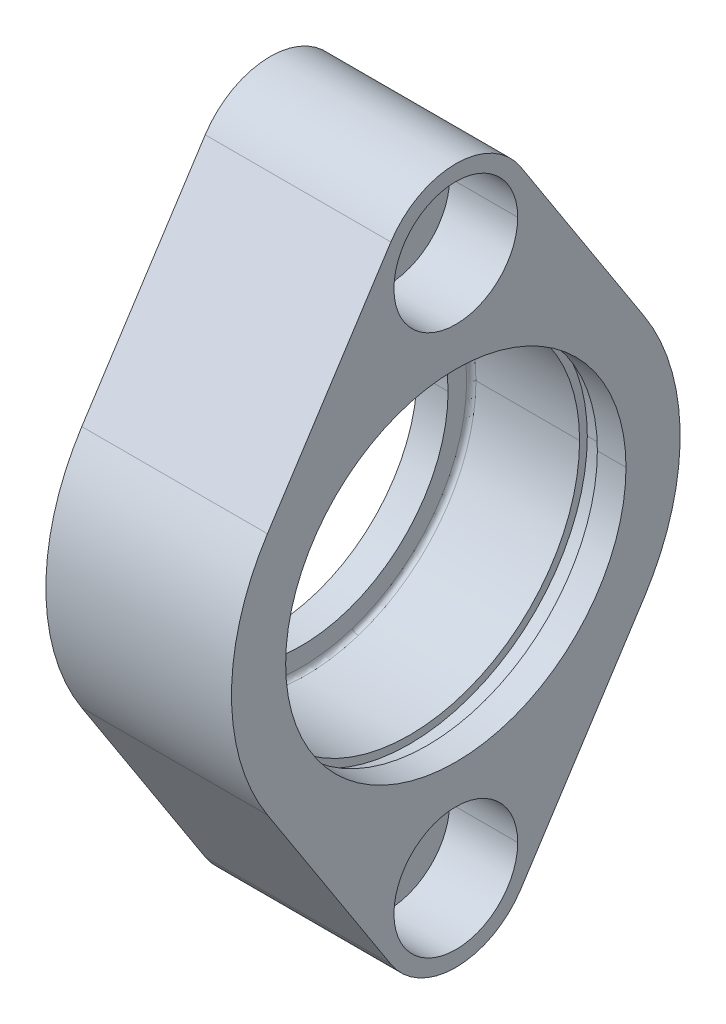
ISO-10303-21;
HEADER;
FILE_DESCRIPTION(('STEP AP214'),'2;1');
FILE_NAME('part.step','',(''),(''),'','','');
FILE_SCHEMA(('AUTOMOTIVE_DESIGN { 1 0 10303 214 1 1 1 1 }'));
ENDSEC;
DATA;
#1=APPLICATION_CONTEXT('core data for automotive mechanical design processes');
#2=APPLICATION_PROTOCOL_DEFINITION('international standard','automotive_design',2000,#1);
#3=PRODUCT_CONTEXT('',#1,'mechanical');
#4=PRODUCT('Part','Part','',(#3));
#5=PRODUCT_RELATED_PRODUCT_CATEGORY('part','',(#4));
#6=PRODUCT_DEFINITION_FORMATION('','',#4);
#7=PRODUCT_DEFINITION_CONTEXT('part definition',#1,'design');
#8=PRODUCT_DEFINITION('design','',#6,#7);
#9=PRODUCT_DEFINITION_SHAPE('','',#8);
#10=(LENGTH_UNIT() NAMED_UNIT(*) SI_UNIT(.MILLI.,.METRE.));
#11=(NAMED_UNIT(*) PLANE_ANGLE_UNIT() SI_UNIT($,.RADIAN.));
#12=(NAMED_UNIT(*) SI_UNIT($,.STERADIAN.) SOLID_ANGLE_UNIT());
#13=UNCERTAINTY_MEASURE_WITH_UNIT(LENGTH_MEASURE(1.E-05),#10,'distance_accuracy_value','');
#14=(GEOMETRIC_REPRESENTATION_CONTEXT(3) GLOBAL_UNCERTAINTY_ASSIGNED_CONTEXT((#13)) GLOBAL_UNIT_ASSIGNED_CONTEXT((#10,
#11,#12)) REPRESENTATION_CONTEXT('',''));
#15=CARTESIAN_POINT('',(0.,0.,0.));
#16=DIRECTION('',(0.,0.,1.));
#17=DIRECTION('',(1.,0.,0.));
#18=AXIS2_PLACEMENT_3D('',#15,#16,#17);
#19=CARTESIAN_POINT('',(44.,0.,0.));
#20=DIRECTION('',(1.,0.,0.));
#21=DIRECTION('',(0.,1.,0.));
#22=AXIS2_PLACEMENT_3D('',#19,#20,#21);
#23=CYLINDRICAL_SURFACE('',#22,11.);
#24=DIRECTION('',(1.,0.,0.));
#25=VECTOR('',#24,1.);
#26=CARTESIAN_POINT('',(-3.7,0.,11.));
#27=LINE('',#26,#25);
#28=CARTESIAN_POINT('',(-3.7,0.,11.));
#29=VERTEX_POINT('',#28);
#30=CARTESIAN_POINT('',(3.,0.,11.));
#31=VERTEX_POINT('',#30);
#32=EDGE_CURVE('E11',#29,#31,#27,.T.);
#33=ORIENTED_EDGE('',*,*,#32,.T.);
#34=CARTESIAN_POINT('',(3.,0.,0.));
#35=DIRECTION('',(1.,0.,0.));
#36=DIRECTION('',(0.,0.,-1.));
#37=AXIS2_PLACEMENT_3D('',#34,#35,#36);
#38=CIRCLE('',#37,11.);
#39=CARTESIAN_POINT('',(3.,0.,-11.));
#40=VERTEX_POINT('',#39);
#41=EDGE_CURVE('E24',#31,#40,#38,.T.);
#42=ORIENTED_EDGE('',*,*,#41,.T.);
#43=DIRECTION('',(1.,0.,0.));
#44=VECTOR('',#43,1.);
#45=CARTESIAN_POINT('',(-3.7,0.,-11.));
#46=LINE('',#45,#44);
#47=CARTESIAN_POINT('',(-3.7,0.,-11.));
#48=VERTEX_POINT('',#47);
#49=EDGE_CURVE('E536',#48,#40,#46,.T.);
#50=ORIENTED_EDGE('',*,*,#49,.F.);
#51=CARTESIAN_POINT('',(-3.7,0.,0.));
#52=DIRECTION('',(1.,0.,0.));
#53=DIRECTION('',(0.,0.,-1.));
#54=AXIS2_PLACEMENT_3D('',#51,#52,#53);
#55=CIRCLE('',#54,11.);
#56=CARTESIAN_POINT('',(-3.7,-10.4616216792467,-3.39918693812442));
#57=VERTEX_POINT('',#56);
#58=EDGE_CURVE('E531',#57,#48,#55,.T.);
#59=ORIENTED_EDGE('',*,*,#58,.F.);
#60=CARTESIAN_POINT('',(-3.7,0.,0.));
#61=DIRECTION('',(1.,0.,0.));
#62=DIRECTION('',(0.,0.,-1.));
#63=AXIS2_PLACEMENT_3D('',#60,#61,#62);
#64=CIRCLE('',#63,11.);
#65=EDGE_CURVE('E526',#29,#57,#64,.T.);
#66=ORIENTED_EDGE('',*,*,#65,.F.);
#67=EDGE_LOOP('',(#33,#42,#50,#59,#66));
#68=FACE_BOUND('',#67,.T.);
#69=ADVANCED_FACE('F16',(#68),#23,.F.);
#70=CARTESIAN_POINT('',(-3.70000000000012,0.,0.));
#71=DIRECTION('',(1.,0.,0.));
#72=DIRECTION('',(0.,0.309016994374947,-0.951056516295154));
#73=AXIS2_PLACEMENT_3D('',#70,#71,#72);
#74=TOROIDAL_SURFACE('',#73,10.7000000000001,0.299999999999874);
#75=CARTESIAN_POINT('',(-3.70000000000012,-10.1763047243583,-3.30648183981197));
#76=DIRECTION('',(0.,0.309016994374948,-0.951056516295153));
#77=DIRECTION('',(4.14483262526899E-13,-0.951056516295153,-0.309016994374948));
#78=AXIS2_PLACEMENT_3D('',#75,#76,#77);
#79=CIRCLE('',#78,0.299999999999874);
#80=CARTESIAN_POINT('',(-4.,-10.1763047243583,-3.30648183981197));
#81=VERTEX_POINT('',#80);
#82=EDGE_CURVE('E522',#57,#81,#79,.T.);
#83=ORIENTED_EDGE('',*,*,#82,.T.);
#84=CARTESIAN_POINT('',(-4.,0.,0.));
#85=DIRECTION('',(1.,0.,0.));
#86=DIRECTION('',(0.,0.,-1.));
#87=AXIS2_PLACEMENT_3D('',#84,#85,#86);
#88=CIRCLE('',#87,10.7);
#89=CARTESIAN_POINT('',(-4.,10.1763047243583,3.30648183981197));
#90=VERTEX_POINT('',#89);
#91=EDGE_CURVE('E517',#90,#81,#88,.T.);
#92=ORIENTED_EDGE('',*,*,#91,.F.);
#93=CARTESIAN_POINT('',(-3.70000000000012,10.1763047243583,3.30648183981197));
#94=DIRECTION('',(0.,-0.309016994374948,0.951056516295153));
#95=DIRECTION('',(4.15963559893067E-13,0.951056516295153,0.309016994374948));
#96=AXIS2_PLACEMENT_3D('',#93,#94,#95);
#97=CIRCLE('',#96,0.299999999999874);
#98=CARTESIAN_POINT('',(-3.7,10.4616216792467,3.39918693812442));
#99=VERTEX_POINT('',#98);
#100=EDGE_CURVE('E512',#99,#90,#97,.T.);
#101=ORIENTED_EDGE('',*,*,#100,.F.);
#102=CARTESIAN_POINT('',(-3.7,0.,0.));
#103=DIRECTION('',(1.,0.,0.));
#104=DIRECTION('',(0.,0.,-1.));
#105=AXIS2_PLACEMENT_3D('',#102,#103,#104);
#106=CIRCLE('',#105,11.);
#107=EDGE_CURVE('E507',#99,#29,#106,.T.);
#108=ORIENTED_EDGE('',*,*,#107,.T.);
#109=ORIENTED_EDGE('',*,*,#65,.T.);
#110=EDGE_LOOP('',(#83,#92,#101,#108,#109));
#111=FACE_BOUND('',#110,.T.);
#112=ADVANCED_FACE('F556',(#111),#74,.F.);
#113=CARTESIAN_POINT('',(44.,0.,0.));
#114=DIRECTION('',(1.,0.,0.));
#115=DIRECTION('',(0.,-1.,0.));
#116=AXIS2_PLACEMENT_3D('',#113,#114,#115);
#117=CYLINDRICAL_SURFACE('',#116,11.);
#118=ORIENTED_EDGE('',*,*,#32,.F.);
#119=ORIENTED_EDGE('',*,*,#107,.F.);
#120=CARTESIAN_POINT('',(-3.7,0.,0.));
#121=DIRECTION('',(1.,0.,0.));
#122=DIRECTION('',(0.,0.,-1.));
#123=AXIS2_PLACEMENT_3D('',#120,#121,#122);
#124=CIRCLE('',#123,11.);
#125=EDGE_CURVE('E502',#48,#99,#124,.T.);
#126=ORIENTED_EDGE('',*,*,#125,.F.);
#127=ORIENTED_EDGE('',*,*,#49,.T.);
#128=CARTESIAN_POINT('',(3.,0.,0.));
#129=DIRECTION('',(1.,0.,0.));
#130=DIRECTION('',(0.,0.,-1.));
#131=AXIS2_PLACEMENT_3D('',#128,#129,#130);
#132=CIRCLE('',#131,11.);
#133=EDGE_CURVE('E498',#40,#31,#132,.T.);
#134=ORIENTED_EDGE('',*,*,#133,.T.);
#135=EDGE_LOOP('',(#118,#119,#126,#127,#134));
#136=FACE_BOUND('',#135,.T.);
#137=ADVANCED_FACE('F547',(#136),#117,.F.);
#138=CARTESIAN_POINT('',(3.,0.,0.));
#139=DIRECTION('',(1.,0.,0.));
#140=DIRECTION('',(0.,0.,-1.));
#141=AXIS2_PLACEMENT_3D('',#138,#139,#140);
#142=PLANE('',#141);
#143=CARTESIAN_POINT('',(3.,0.,0.));
#144=DIRECTION('',(1.,0.,0.));
#145=DIRECTION('',(0.,0.,-1.));
#146=AXIS2_PLACEMENT_3D('',#143,#144,#145);
#147=CIRCLE('',#146,11.5);
#148=CARTESIAN_POINT('',(3.,0.,-11.5));
#149=VERTEX_POINT('',#148);
#150=CARTESIAN_POINT('',(3.,0.,11.5));
#151=VERTEX_POINT('',#150);
#152=EDGE_CURVE('E494',#149,#151,#147,.T.);
#153=ORIENTED_EDGE('',*,*,#152,.T.);
#154=CARTESIAN_POINT('',(3.,0.,0.));
#155=DIRECTION('',(1.,0.,0.));
#156=DIRECTION('',(0.,0.,-1.));
#157=AXIS2_PLACEMENT_3D('',#154,#155,#156);
#158=CIRCLE('',#157,11.5);
#159=EDGE_CURVE('E490',#151,#149,#158,.T.);
#160=ORIENTED_EDGE('',*,*,#159,.T.);
#161=EDGE_LOOP('',(#153,#160));
#162=FACE_BOUND('',#161,.T.);
#163=ORIENTED_EDGE('',*,*,#41,.F.);
#164=ORIENTED_EDGE('',*,*,#133,.F.);
#165=EDGE_LOOP('',(#163,#164));
#166=FACE_BOUND('',#165,.T.);
#167=ADVANCED_FACE('F677',(#162,#166),#142,.T.);
#168=CARTESIAN_POINT('',(4.15,0.,0.));
#169=DIRECTION('',(1.,0.,0.));
#170=DIRECTION('',(0.,1.,0.));
#171=AXIS2_PLACEMENT_3D('',#168,#169,#170);
#172=CYLINDRICAL_SURFACE('',#171,11.5);
#173=DIRECTION('',(1.,0.,0.));
#174=VECTOR('',#173,1.);
#175=CARTESIAN_POINT('',(3.,0.,11.5));
#176=LINE('',#175,#174);
#177=CARTESIAN_POINT('',(4.15,0.,11.5));
#178=VERTEX_POINT('',#177);
#179=EDGE_CURVE('E486',#151,#178,#176,.T.);
#180=ORIENTED_EDGE('',*,*,#179,.T.);
#181=CARTESIAN_POINT('',(4.15,0.,0.));
#182=DIRECTION('',(1.,0.,0.));
#183=DIRECTION('',(0.,0.,-1.));
#184=AXIS2_PLACEMENT_3D('',#181,#182,#183);
#185=CIRCLE('',#184,11.5);
#186=CARTESIAN_POINT('',(4.15,0.,-11.5));
#187=VERTEX_POINT('',#186);
#188=EDGE_CURVE('E482',#178,#187,#185,.T.);
#189=ORIENTED_EDGE('',*,*,#188,.T.);
#190=DIRECTION('',(1.,0.,0.));
#191=VECTOR('',#190,1.);
#192=CARTESIAN_POINT('',(3.,0.,-11.5));
#193=LINE('',#192,#191);
#194=EDGE_CURVE('E477',#149,#187,#193,.T.);
#195=ORIENTED_EDGE('',*,*,#194,.F.);
#196=ORIENTED_EDGE('',*,*,#159,.F.);
#197=EDGE_LOOP('',(#180,#189,#195,#196));
#198=FACE_BOUND('',#197,.T.);
#199=ADVANCED_FACE('F673',(#198),#172,.F.);
#200=CARTESIAN_POINT('',(4.15,0.,0.));
#201=DIRECTION('',(1.,0.,0.));
#202=DIRECTION('',(0.,-1.,0.));
#203=AXIS2_PLACEMENT_3D('',#200,#201,#202);
#204=CYLINDRICAL_SURFACE('',#203,11.5);
#205=ORIENTED_EDGE('',*,*,#179,.F.);
#206=ORIENTED_EDGE('',*,*,#152,.F.);
#207=ORIENTED_EDGE('',*,*,#194,.T.);
#208=CARTESIAN_POINT('',(4.15,0.,0.));
#209=DIRECTION('',(1.,0.,0.));
#210=DIRECTION('',(0.,0.,-1.));
#211=AXIS2_PLACEMENT_3D('',#208,#209,#210);
#212=CIRCLE('',#211,11.5);
#213=EDGE_CURVE('E472',#187,#178,#212,.T.);
#214=ORIENTED_EDGE('',*,*,#213,.T.);
#215=EDGE_LOOP('',(#205,#206,#207,#214));
#216=FACE_BOUND('',#215,.T.);
#217=ADVANCED_FACE('F669',(#216),#204,.F.);
#218=CARTESIAN_POINT('',(4.15,11.5,0.));
#219=DIRECTION('',(-1.,0.,0.));
#220=DIRECTION('',(0.,0.,1.));
#221=AXIS2_PLACEMENT_3D('',#218,#219,#220);
#222=PLANE('',#221);
#223=CARTESIAN_POINT('',(4.15,0.,0.));
#224=DIRECTION('',(-1.,0.,0.));
#225=DIRECTION('',(0.,0.,1.));
#226=AXIS2_PLACEMENT_3D('',#223,#224,#225);
#227=CIRCLE('',#226,11.);
#228=CARTESIAN_POINT('',(4.15,0.,-11.));
#229=VERTEX_POINT('',#228);
#230=CARTESIAN_POINT('',(4.15,0.,11.));
#231=VERTEX_POINT('',#230);
#232=EDGE_CURVE('E467',#229,#231,#227,.T.);
#233=ORIENTED_EDGE('',*,*,#232,.F.);
#234=CARTESIAN_POINT('',(4.15,0.,0.));
#235=DIRECTION('',(-1.,0.,0.));
#236=DIRECTION('',(0.,0.,1.));
#237=AXIS2_PLACEMENT_3D('',#234,#235,#236);
#238=CIRCLE('',#237,11.);
#239=EDGE_CURVE('E462',#231,#229,#238,.T.);
#240=ORIENTED_EDGE('',*,*,#239,.F.);
#241=EDGE_LOOP('',(#233,#240));
#242=FACE_BOUND('',#241,.T.);
#243=ORIENTED_EDGE('',*,*,#188,.F.);
#244=ORIENTED_EDGE('',*,*,#213,.F.);
#245=EDGE_LOOP('',(#243,#244));
#246=FACE_BOUND('',#245,.T.);
#247=ADVANCED_FACE('F665',(#242,#246),#222,.T.);
#248=CARTESIAN_POINT('',(44.,0.,0.));
#249=DIRECTION('',(1.,0.,0.));
#250=DIRECTION('',(0.,-1.,0.));
#251=AXIS2_PLACEMENT_3D('',#248,#249,#250);
#252=CYLINDRICAL_SURFACE('',#251,11.);
#253=DIRECTION('',(1.,0.,0.));
#254=VECTOR('',#253,1.);
#255=CARTESIAN_POINT('',(4.15,0.,11.));
#256=LINE('',#255,#254);
#257=CARTESIAN_POINT('',(6.,0.,11.));
#258=VERTEX_POINT('',#257);
#259=EDGE_CURVE('E457',#231,#258,#256,.T.);
#260=ORIENTED_EDGE('',*,*,#259,.F.);
#261=ORIENTED_EDGE('',*,*,#239,.T.);
#262=DIRECTION('',(1.,0.,0.));
#263=VECTOR('',#262,1.);
#264=CARTESIAN_POINT('',(4.15,0.,-11.));
#265=LINE('',#264,#263);
#266=CARTESIAN_POINT('',(6.,0.,-11.));
#267=VERTEX_POINT('',#266);
#268=EDGE_CURVE('E453',#229,#267,#265,.T.);
#269=ORIENTED_EDGE('',*,*,#268,.T.);
#270=CARTESIAN_POINT('',(6.,0.,0.));
#271=DIRECTION('',(1.,0.,0.));
#272=DIRECTION('',(0.,0.,-1.));
#273=AXIS2_PLACEMENT_3D('',#270,#271,#272);
#274=CIRCLE('',#273,11.);
#275=EDGE_CURVE('E449',#267,#258,#274,.T.);
#276=ORIENTED_EDGE('',*,*,#275,.T.);
#277=EDGE_LOOP('',(#260,#261,#269,#276));
#278=FACE_BOUND('',#277,.T.);
#279=ADVANCED_FACE('F661',(#278),#252,.F.);
#280=CARTESIAN_POINT('',(6.,11.,0.));
#281=DIRECTION('',(1.,0.,0.));
#282=DIRECTION('',(0.,0.,-1.));
#283=AXIS2_PLACEMENT_3D('',#280,#281,#282);
#284=PLANE('',#283);
#285=DIRECTION('',(0.,-0.839825054668509,-0.542857142857158));
#286=VECTOR('',#285,1.);
#287=CARTESIAN_POINT('',(6.,15.6297959183676,-7.1625079662445));
#288=LINE('',#287,#286);
#289=CARTESIAN_POINT('',(6.,20.214285714286,-4.1991252733426));
#290=VERTEX_POINT('',#289);
#291=CARTESIAN_POINT('',(6.,7.8714285714286,-12.177463292694));
#292=VERTEX_POINT('',#291);
#293=EDGE_CURVE('E444',#290,#292,#288,.T.);
#294=ORIENTED_EDGE('',*,*,#293,.F.);
#295=CARTESIAN_POINT('',(6.,17.4999999999997,0.));
#296=DIRECTION('',(-1.,0.,0.));
#297=DIRECTION('',(0.,0.,-1.));
#298=AXIS2_PLACEMENT_3D('',#295,#296,#297);
#299=CIRCLE('',#298,5.00000000000036);
#300=CARTESIAN_POINT('',(6.,20.214285714286,4.1991252733426));
#301=VERTEX_POINT('',#300);
#302=EDGE_CURVE('E439',#301,#290,#299,.T.);
#303=ORIENTED_EDGE('',*,*,#302,.F.);
#304=DIRECTION('',(0.,0.839825054668509,-0.542857142857158));
#305=VECTOR('',#304,1.);
#306=CARTESIAN_POINT('',(6.,15.6297959183676,7.1625079662445));
#307=LINE('',#306,#305);
#308=CARTESIAN_POINT('',(6.,7.8714285714286,12.177463292694));
#309=VERTEX_POINT('',#308);
#310=EDGE_CURVE('E434',#309,#301,#307,.T.);
#311=ORIENTED_EDGE('',*,*,#310,.F.);
#312=CARTESIAN_POINT('',(6.,0.,-2.65065747129256E-12));
#313=DIRECTION('',(-1.,0.,0.));
#314=DIRECTION('',(0.,0.,-1.));
#315=AXIS2_PLACEMENT_3D('',#312,#313,#314);
#316=CIRCLE('',#315,14.5000000000026);
#317=CARTESIAN_POINT('',(6.,-7.8714285714286,12.177463292694));
#318=VERTEX_POINT('',#317);
#319=EDGE_CURVE('E429',#318,#309,#316,.T.);
#320=ORIENTED_EDGE('',*,*,#319,.F.);
#321=DIRECTION('',(0.,0.839825054668509,0.542857142857158));
#322=VECTOR('',#321,1.);
#323=CARTESIAN_POINT('',(6.,-0.113061224490424,17.1924186191429));
#324=LINE('',#323,#322);
#325=CARTESIAN_POINT('',(6.,-20.214285714286,4.1991252733426));
#326=VERTEX_POINT('',#325);
#327=EDGE_CURVE('E424',#326,#318,#324,.T.);
#328=ORIENTED_EDGE('',*,*,#327,.F.);
#329=CARTESIAN_POINT('',(6.,-17.4999999999997,0.));
#330=DIRECTION('',(-1.,0.,0.));
#331=DIRECTION('',(0.,0.,-1.));
#332=AXIS2_PLACEMENT_3D('',#329,#330,#331);
#333=CIRCLE('',#332,5.00000000000036);
#334=CARTESIAN_POINT('',(6.,-20.214285714286,-4.1991252733426));
#335=VERTEX_POINT('',#334);
#336=EDGE_CURVE('E419',#335,#326,#333,.T.);
#337=ORIENTED_EDGE('',*,*,#336,.F.);
#338=DIRECTION('',(0.,-0.839825054668509,0.542857142857158));
#339=VECTOR('',#338,1.);
#340=CARTESIAN_POINT('',(6.,-0.113061224490424,-17.1924186191429));
#341=LINE('',#340,#339);
#342=CARTESIAN_POINT('',(6.,-7.8714285714286,-12.177463292694));
#343=VERTEX_POINT('',#342);
#344=EDGE_CURVE('E414',#343,#335,#341,.T.);
#345=ORIENTED_EDGE('',*,*,#344,.F.);
#346=CARTESIAN_POINT('',(6.,0.,2.65065747129256E-12));
#347=DIRECTION('',(-1.,0.,0.));
#348=DIRECTION('',(0.,0.,-1.));
#349=AXIS2_PLACEMENT_3D('',#346,#347,#348);
#350=CIRCLE('',#349,14.5000000000026);
#351=EDGE_CURVE('E409',#292,#343,#350,.T.);
#352=ORIENTED_EDGE('',*,*,#351,.F.);
#353=EDGE_LOOP('',(#294,#303,#311,#320,#328,#337,#345,#352));
#354=FACE_BOUND('',#353,.T.);
#355=CARTESIAN_POINT('',(6.,17.5,0.));
#356=DIRECTION('',(-1.,0.,0.));
#357=DIRECTION('',(0.,0.,-1.));
#358=AXIS2_PLACEMENT_3D('',#355,#356,#357);
#359=CIRCLE('',#358,4.);
#360=CARTESIAN_POINT('',(6.,17.5,-4.));
#361=VERTEX_POINT('',#360);
#362=CARTESIAN_POINT('',(6.,17.5,4.));
#363=VERTEX_POINT('',#362);
#364=EDGE_CURVE('E405',#361,#363,#359,.T.);
#365=ORIENTED_EDGE('',*,*,#364,.T.);
#366=CARTESIAN_POINT('',(6.,17.5,0.));
#367=DIRECTION('',(-1.,0.,0.));
#368=DIRECTION('',(0.,0.,-1.));
#369=AXIS2_PLACEMENT_3D('',#366,#367,#368);
#370=CIRCLE('',#369,4.);
#371=EDGE_CURVE('E401',#363,#361,#370,.T.);
#372=ORIENTED_EDGE('',*,*,#371,.T.);
#373=EDGE_LOOP('',(#365,#372));
#374=FACE_BOUND('',#373,.T.);
#375=CARTESIAN_POINT('',(6.,-17.5,0.));
#376=DIRECTION('',(-1.,0.,0.));
#377=DIRECTION('',(0.,0.,1.));
#378=AXIS2_PLACEMENT_3D('',#375,#376,#377);
#379=CIRCLE('',#378,4.);
#380=CARTESIAN_POINT('',(6.,-17.5,4.));
#381=VERTEX_POINT('',#380);
#382=CARTESIAN_POINT('',(6.,-17.5,-4.));
#383=VERTEX_POINT('',#382);
#384=EDGE_CURVE('E397',#381,#383,#379,.T.);
#385=ORIENTED_EDGE('',*,*,#384,.T.);
#386=CARTESIAN_POINT('',(6.,-17.5,0.));
#387=DIRECTION('',(-1.,0.,0.));
#388=DIRECTION('',(0.,0.,1.));
#389=AXIS2_PLACEMENT_3D('',#386,#387,#388);
#390=CIRCLE('',#389,4.);
#391=EDGE_CURVE('E393',#383,#381,#390,.T.);
#392=ORIENTED_EDGE('',*,*,#391,.T.);
#393=EDGE_LOOP('',(#385,#392));
#394=FACE_BOUND('',#393,.T.);
#395=CARTESIAN_POINT('',(6.,0.,0.));
#396=DIRECTION('',(1.,0.,0.));
#397=DIRECTION('',(0.,0.,-1.));
#398=AXIS2_PLACEMENT_3D('',#395,#396,#397);
#399=CIRCLE('',#398,11.);
#400=EDGE_CURVE('E388',#258,#267,#399,.T.);
#401=ORIENTED_EDGE('',*,*,#400,.F.);
#402=ORIENTED_EDGE('',*,*,#275,.F.);
#403=EDGE_LOOP('',(#401,#402));
#404=FACE_BOUND('',#403,.T.);
#405=ADVANCED_FACE('F657',(#354,#374,#394,#404),#284,.T.);
#406=CARTESIAN_POINT('',(44.,0.,0.));
#407=DIRECTION('',(1.,0.,0.));
#408=DIRECTION('',(0.,1.,0.));
#409=AXIS2_PLACEMENT_3D('',#406,#407,#408);
#410=CYLINDRICAL_SURFACE('',#409,11.);
#411=ORIENTED_EDGE('',*,*,#259,.T.);
#412=ORIENTED_EDGE('',*,*,#400,.T.);
#413=ORIENTED_EDGE('',*,*,#268,.F.);
#414=ORIENTED_EDGE('',*,*,#232,.T.);
#415=EDGE_LOOP('',(#411,#412,#413,#414));
#416=FACE_BOUND('',#415,.T.);
#417=ADVANCED_FACE('F653',(#416),#410,.F.);
#418=CARTESIAN_POINT('',(-6.,-17.5,0.));
#419=DIRECTION('',(-1.,0.,0.));
#420=DIRECTION('',(0.,1.,0.));
#421=AXIS2_PLACEMENT_3D('',#418,#419,#420);
#422=CYLINDRICAL_SURFACE('',#421,4.);
#423=DIRECTION('',(-1.,0.,0.));
#424=VECTOR('',#423,1.);
#425=CARTESIAN_POINT('',(6.,-17.5,-4.));
#426=LINE('',#425,#424);
#427=CARTESIAN_POINT('',(1.6,-17.5,-4.));
#428=VERTEX_POINT('',#427);
#429=EDGE_CURVE('E384',#383,#428,#426,.T.);
#430=ORIENTED_EDGE('',*,*,#429,.T.);
#431=CARTESIAN_POINT('',(1.6,-17.5,0.));
#432=DIRECTION('',(-1.,0.,0.));
#433=DIRECTION('',(0.,0.,1.));
#434=AXIS2_PLACEMENT_3D('',#431,#432,#433);
#435=CIRCLE('',#434,4.);
#436=CARTESIAN_POINT('',(1.6,-17.5,4.));
#437=VERTEX_POINT('',#436);
#438=EDGE_CURVE('E380',#428,#437,#435,.T.);
#439=ORIENTED_EDGE('',*,*,#438,.T.);
#440=DIRECTION('',(-1.,0.,0.));
#441=VECTOR('',#440,1.);
#442=CARTESIAN_POINT('',(6.,-17.5,4.));
#443=LINE('',#442,#441);
#444=EDGE_CURVE('E375',#381,#437,#443,.T.);
#445=ORIENTED_EDGE('',*,*,#444,.F.);
#446=ORIENTED_EDGE('',*,*,#391,.F.);
#447=EDGE_LOOP('',(#430,#439,#445,#446));
#448=FACE_BOUND('',#447,.T.);
#449=ADVANCED_FACE('F649',(#448),#422,.F.);
#450=CARTESIAN_POINT('',(-6.,-17.5,0.));
#451=DIRECTION('',(-1.,0.,0.));
#452=DIRECTION('',(0.,-1.,0.));
#453=AXIS2_PLACEMENT_3D('',#450,#451,#452);
#454=CYLINDRICAL_SURFACE('',#453,4.);
#455=ORIENTED_EDGE('',*,*,#429,.F.);
#456=ORIENTED_EDGE('',*,*,#384,.F.);
#457=ORIENTED_EDGE('',*,*,#444,.T.);
#458=CARTESIAN_POINT('',(1.6,-17.5,0.));
#459=DIRECTION('',(-1.,0.,0.));
#460=DIRECTION('',(0.,0.,1.));
#461=AXIS2_PLACEMENT_3D('',#458,#459,#460);
#462=CIRCLE('',#461,4.);
#463=EDGE_CURVE('E370',#437,#428,#462,.T.);
#464=ORIENTED_EDGE('',*,*,#463,.T.);
#465=EDGE_LOOP('',(#455,#456,#457,#464));
#466=FACE_BOUND('',#465,.T.);
#467=ADVANCED_FACE('F645',(#466),#454,.F.);
#468=CARTESIAN_POINT('',(1.6,-21.5,0.));
#469=DIRECTION('',(1.,0.,0.));
#470=DIRECTION('',(0.,0.,-1.));
#471=AXIS2_PLACEMENT_3D('',#468,#469,#470);
#472=PLANE('',#471);
#473=CARTESIAN_POINT('',(1.6,-17.5,0.));
#474=DIRECTION('',(-1.,0.,0.));
#475=DIRECTION('',(0.,0.,1.));
#476=AXIS2_PLACEMENT_3D('',#473,#474,#475);
#477=CIRCLE('',#476,2.067);
#478=CARTESIAN_POINT('',(1.6,-17.5,2.067));
#479=VERTEX_POINT('',#478);
#480=CARTESIAN_POINT('',(1.6,-17.5,-2.067));
#481=VERTEX_POINT('',#480);
#482=EDGE_CURVE('E366',#479,#481,#477,.T.);
#483=ORIENTED_EDGE('',*,*,#482,.T.);
#484=CARTESIAN_POINT('',(1.6,-17.5,0.));
#485=DIRECTION('',(-1.,0.,0.));
#486=DIRECTION('',(0.,0.,1.));
#487=AXIS2_PLACEMENT_3D('',#484,#485,#486);
#488=CIRCLE('',#487,2.067);
#489=EDGE_CURVE('E362',#481,#479,#488,.T.);
#490=ORIENTED_EDGE('',*,*,#489,.T.);
#491=EDGE_LOOP('',(#483,#490));
#492=FACE_BOUND('',#491,.T.);
#493=ORIENTED_EDGE('',*,*,#438,.F.);
#494=ORIENTED_EDGE('',*,*,#463,.F.);
#495=EDGE_LOOP('',(#493,#494));
#496=FACE_BOUND('',#495,.T.);
#497=ADVANCED_FACE('F641',(#492,#496),#472,.T.);
#498=CARTESIAN_POINT('',(-6.,-17.5,0.));
#499=DIRECTION('',(-1.,0.,0.));
#500=DIRECTION('',(0.,1.,0.));
#501=AXIS2_PLACEMENT_3D('',#498,#499,#500);
#502=CYLINDRICAL_SURFACE('',#501,2.067);
#503=DIRECTION('',(-1.,0.,0.));
#504=VECTOR('',#503,1.);
#505=CARTESIAN_POINT('',(1.6,-17.5,-2.067));
#506=LINE('',#505,#504);
#507=CARTESIAN_POINT('',(-6.,-17.5,-2.067));
#508=VERTEX_POINT('',#507);
#509=EDGE_CURVE('E358',#481,#508,#506,.T.);
#510=ORIENTED_EDGE('',*,*,#509,.T.);
#511=CARTESIAN_POINT('',(-6.,-17.5,0.));
#512=DIRECTION('',(-1.,0.,0.));
#513=DIRECTION('',(0.,0.,1.));
#514=AXIS2_PLACEMENT_3D('',#511,#512,#513);
#515=CIRCLE('',#514,2.067);
#516=CARTESIAN_POINT('',(-6.,-17.5,2.067));
#517=VERTEX_POINT('',#516);
#518=EDGE_CURVE('E354',#508,#517,#515,.T.);
#519=ORIENTED_EDGE('',*,*,#518,.T.);
#520=DIRECTION('',(-1.,0.,0.));
#521=VECTOR('',#520,1.);
#522=CARTESIAN_POINT('',(1.6,-17.5,2.067));
#523=LINE('',#522,#521);
#524=EDGE_CURVE('E349',#479,#517,#523,.T.);
#525=ORIENTED_EDGE('',*,*,#524,.F.);
#526=ORIENTED_EDGE('',*,*,#489,.F.);
#527=EDGE_LOOP('',(#510,#519,#525,#526));
#528=FACE_BOUND('',#527,.T.);
#529=ADVANCED_FACE('F637',(#528),#502,.F.);
#530=CARTESIAN_POINT('',(-6.,-17.5,0.));
#531=DIRECTION('',(-1.,0.,0.));
#532=DIRECTION('',(0.,-1.,0.));
#533=AXIS2_PLACEMENT_3D('',#530,#531,#532);
#534=CYLINDRICAL_SURFACE('',#533,2.067);
#535=ORIENTED_EDGE('',*,*,#509,.F.);
#536=ORIENTED_EDGE('',*,*,#482,.F.);
#537=ORIENTED_EDGE('',*,*,#524,.T.);
#538=CARTESIAN_POINT('',(-6.,-17.5,0.));
#539=DIRECTION('',(-1.,0.,0.));
#540=DIRECTION('',(0.,0.,1.));
#541=AXIS2_PLACEMENT_3D('',#538,#539,#540);
#542=CIRCLE('',#541,2.067);
#543=EDGE_CURVE('E344',#517,#508,#542,.T.);
#544=ORIENTED_EDGE('',*,*,#543,.T.);
#545=EDGE_LOOP('',(#535,#536,#537,#544));
#546=FACE_BOUND('',#545,.T.);
#547=ADVANCED_FACE('F633',(#546),#534,.F.);
#548=CARTESIAN_POINT('',(-6.,22.5,0.));
#549=DIRECTION('',(-1.,0.,0.));
#550=DIRECTION('',(0.,0.,1.));
#551=AXIS2_PLACEMENT_3D('',#548,#549,#550);
#552=PLANE('',#551);
#553=CARTESIAN_POINT('',(-6.,0.,0.));
#554=DIRECTION('',(1.,0.,0.));
#555=DIRECTION('',(0.,0.,-1.));
#556=AXIS2_PLACEMENT_3D('',#553,#554,#555);
#557=CIRCLE('',#556,9.5);
#558=CARTESIAN_POINT('',(-6.,0.,-9.5));
#559=VERTEX_POINT('',#558);
#560=CARTESIAN_POINT('',(-6.,0.,9.5));
#561=VERTEX_POINT('',#560);
#562=EDGE_CURVE('E203',#559,#561,#557,.T.);
#563=ORIENTED_EDGE('',*,*,#562,.T.);
#564=CARTESIAN_POINT('',(-6.,0.,0.));
#565=DIRECTION('',(1.,0.,0.));
#566=DIRECTION('',(0.,0.,-1.));
#567=AXIS2_PLACEMENT_3D('',#564,#565,#566);
#568=CIRCLE('',#567,9.5);
#569=EDGE_CURVE('E337',#561,#559,#568,.T.);
#570=ORIENTED_EDGE('',*,*,#569,.T.);
#571=EDGE_LOOP('',(#563,#570));
#572=FACE_BOUND('',#571,.T.);
#573=CARTESIAN_POINT('',(-6.,17.5,0.));
#574=DIRECTION('',(1.,0.,0.));
#575=DIRECTION('',(0.,0.,1.));
#576=AXIS2_PLACEMENT_3D('',#573,#574,#575);
#577=CIRCLE('',#576,2.067);
#578=CARTESIAN_POINT('',(-6.,17.5,2.067));
#579=VERTEX_POINT('',#578);
#580=CARTESIAN_POINT('',(-6.,17.5,-2.067));
#581=VERTEX_POINT('',#580);
#582=EDGE_CURVE('E333',#579,#581,#577,.T.);
#583=ORIENTED_EDGE('',*,*,#582,.T.);
#584=CARTESIAN_POINT('',(-6.,17.5,0.));
#585=DIRECTION('',(1.,0.,0.));
#586=DIRECTION('',(0.,0.,1.));
#587=AXIS2_PLACEMENT_3D('',#584,#585,#586);
#588=CIRCLE('',#587,2.067);
#589=EDGE_CURVE('E329',#581,#579,#588,.T.);
#590=ORIENTED_EDGE('',*,*,#589,.T.);
#591=EDGE_LOOP('',(#583,#590));
#592=FACE_BOUND('',#591,.T.);
#593=ORIENTED_EDGE('',*,*,#518,.F.);
#594=ORIENTED_EDGE('',*,*,#543,.F.);
#595=EDGE_LOOP('',(#593,#594));
#596=FACE_BOUND('',#595,.T.);
#597=DIRECTION('',(0.,-0.839825054668509,0.542857142857158));
#598=VECTOR('',#597,1.);
#599=CARTESIAN_POINT('',(-6.,23.7408163265307,1.91960012495666));
#600=LINE('',#599,#598);
#601=CARTESIAN_POINT('',(-6.,20.214285714286,4.1991252733426));
#602=VERTEX_POINT('',#601);
#603=CARTESIAN_POINT('',(-6.,7.8714285714286,12.177463292694));
#604=VERTEX_POINT('',#603);
#605=EDGE_CURVE('E324',#602,#604,#600,.T.);
#606=ORIENTED_EDGE('',*,*,#605,.F.);
#607=CARTESIAN_POINT('',(-6.,17.4999999999997,0.));
#608=DIRECTION('',(1.,0.,0.));
#609=DIRECTION('',(0.,0.,1.));
#610=AXIS2_PLACEMENT_3D('',#607,#608,#609);
#611=CIRCLE('',#610,5.00000000000036);
#612=CARTESIAN_POINT('',(-6.,20.214285714286,-4.1991252733426));
#613=VERTEX_POINT('',#612);
#614=EDGE_CURVE('E319',#613,#602,#611,.T.);
#615=ORIENTED_EDGE('',*,*,#614,.F.);
#616=DIRECTION('',(0.,0.839825054668509,0.542857142857158));
#617=VECTOR('',#616,1.);
#618=CARTESIAN_POINT('',(-6.,23.7408163265307,-1.91960012495666));
#619=LINE('',#618,#617);
#620=CARTESIAN_POINT('',(-6.,7.8714285714286,-12.177463292694));
#621=VERTEX_POINT('',#620);
#622=EDGE_CURVE('E314',#621,#613,#619,.T.);
#623=ORIENTED_EDGE('',*,*,#622,.F.);
#624=CARTESIAN_POINT('',(-6.,0.,2.65065747129256E-12));
#625=DIRECTION('',(1.,0.,0.));
#626=DIRECTION('',(0.,0.,1.));
#627=AXIS2_PLACEMENT_3D('',#624,#625,#626);
#628=CIRCLE('',#627,14.5000000000026);
#629=CARTESIAN_POINT('',(-6.,-7.8714285714286,-12.177463292694));
#630=VERTEX_POINT('',#629);
#631=EDGE_CURVE('E309',#630,#621,#628,.T.);
#632=ORIENTED_EDGE('',*,*,#631,.F.);
#633=DIRECTION('',(0.,0.839825054668509,-0.542857142857158));
#634=VECTOR('',#633,1.);
#635=CARTESIAN_POINT('',(-6.,7.99795918367265,-22.4353264604308));
#636=LINE('',#635,#634);
#637=CARTESIAN_POINT('',(-6.,-20.214285714286,-4.1991252733426));
#638=VERTEX_POINT('',#637);
#639=EDGE_CURVE('E304',#638,#630,#636,.T.);
#640=ORIENTED_EDGE('',*,*,#639,.F.);
#641=CARTESIAN_POINT('',(-6.,-17.4999999999997,0.));
#642=DIRECTION('',(1.,0.,0.));
#643=DIRECTION('',(0.,0.,1.));
#644=AXIS2_PLACEMENT_3D('',#641,#642,#643);
#645=CIRCLE('',#644,5.00000000000036);
#646=CARTESIAN_POINT('',(-6.,-20.214285714286,4.1991252733426));
#647=VERTEX_POINT('',#646);
#648=EDGE_CURVE('E299',#647,#638,#645,.T.);
#649=ORIENTED_EDGE('',*,*,#648,.F.);
#650=DIRECTION('',(0.,-0.839825054668509,-0.542857142857158));
#651=VECTOR('',#650,1.);
#652=CARTESIAN_POINT('',(-6.,7.99795918367266,22.4353264604308));
#653=LINE('',#652,#651);
#654=CARTESIAN_POINT('',(-6.,-7.8714285714286,12.177463292694));
#655=VERTEX_POINT('',#654);
#656=EDGE_CURVE('E294',#655,#647,#653,.T.);
#657=ORIENTED_EDGE('',*,*,#656,.F.);
#658=CARTESIAN_POINT('',(-6.,0.,-2.65065747129256E-12));
#659=DIRECTION('',(1.,0.,0.));
#660=DIRECTION('',(0.,0.,1.));
#661=AXIS2_PLACEMENT_3D('',#658,#659,#660);
#662=CIRCLE('',#661,14.5000000000026);
#663=EDGE_CURVE('E289',#604,#655,#662,.T.);
#664=ORIENTED_EDGE('',*,*,#663,.F.);
#665=EDGE_LOOP('',(#606,#615,#623,#632,#640,#649,#657,#664));
#666=FACE_BOUND('',#665,.T.);
#667=ADVANCED_FACE('F629',(#572,#592,#596,#666),#552,.T.);
#668=CARTESIAN_POINT('',(12.,0.,-2.65065747129256E-12));
#669=DIRECTION('',(-1.,0.,0.));
#670=DIRECTION('',(0.,0.,-1.));
#671=AXIS2_PLACEMENT_3D('',#668,#669,#670);
#672=CYLINDRICAL_SURFACE('',#671,14.5000000000026);
#673=ORIENTED_EDGE('',*,*,#663,.T.);
#674=DIRECTION('',(-1.,0.,0.));
#675=VECTOR('',#674,1.);
#676=CARTESIAN_POINT('',(12.,-7.8714285714286,12.177463292694));
#677=LINE('',#676,#675);
#678=EDGE_CURVE('E284',#318,#655,#677,.T.);
#679=ORIENTED_EDGE('',*,*,#678,.F.);
#680=ORIENTED_EDGE('',*,*,#319,.T.);
#681=DIRECTION('',(-1.,0.,0.));
#682=VECTOR('',#681,1.);
#683=CARTESIAN_POINT('',(12.,7.8714285714286,12.177463292694));
#684=LINE('',#683,#682);
#685=EDGE_CURVE('E279',#309,#604,#684,.T.);
#686=ORIENTED_EDGE('',*,*,#685,.T.);
#687=EDGE_LOOP('',(#673,#679,#680,#686));
#688=FACE_BOUND('',#687,.T.);
#689=ADVANCED_FACE('F625',(#688),#672,.T.);
#690=CARTESIAN_POINT('',(12.,20.214285714286,4.1991252733426));
#691=DIRECTION('',(0.,-0.542857142857158,-0.839825054668509));
#692=DIRECTION('',(0.,0.839825054668509,-0.542857142857158));
#693=AXIS2_PLACEMENT_3D('',#690,#691,#692);
#694=PLANE('',#693);
#695=ORIENTED_EDGE('',*,*,#605,.T.);
#696=ORIENTED_EDGE('',*,*,#685,.F.);
#697=ORIENTED_EDGE('',*,*,#310,.T.);
#698=DIRECTION('',(-1.,0.,0.));
#699=VECTOR('',#698,1.);
#700=CARTESIAN_POINT('',(12.,20.214285714286,4.1991252733426));
#701=LINE('',#700,#699);
#702=EDGE_CURVE('E274',#301,#602,#701,.T.);
#703=ORIENTED_EDGE('',*,*,#702,.T.);
#704=EDGE_LOOP('',(#695,#696,#697,#703));
#705=FACE_BOUND('',#704,.T.);
#706=ADVANCED_FACE('F621',(#705),#694,.F.);
#707=CARTESIAN_POINT('',(12.,17.4999999999997,0.));
#708=DIRECTION('',(-1.,0.,0.));
#709=DIRECTION('',(0.,-1.,0.));
#710=AXIS2_PLACEMENT_3D('',#707,#708,#709);
#711=CYLINDRICAL_SURFACE('',#710,5.00000000000036);
#712=ORIENTED_EDGE('',*,*,#614,.T.);
#713=ORIENTED_EDGE('',*,*,#702,.F.);
#714=ORIENTED_EDGE('',*,*,#302,.T.);
#715=DIRECTION('',(-1.,0.,0.));
#716=VECTOR('',#715,1.);
#717=CARTESIAN_POINT('',(12.,20.214285714286,-4.1991252733426));
#718=LINE('',#717,#716);
#719=EDGE_CURVE('E269',#290,#613,#718,.T.);
#720=ORIENTED_EDGE('',*,*,#719,.T.);
#721=EDGE_LOOP('',(#712,#713,#714,#720));
#722=FACE_BOUND('',#721,.T.);
#723=ADVANCED_FACE('F617',(#722),#711,.T.);
#724=CARTESIAN_POINT('',(12.,7.8714285714286,-12.177463292694));
#725=DIRECTION('',(0.,-0.542857142857158,0.839825054668509));
#726=DIRECTION('',(0.,-0.839825054668509,-0.542857142857158));
#727=AXIS2_PLACEMENT_3D('',#724,#725,#726);
#728=PLANE('',#727);
#729=ORIENTED_EDGE('',*,*,#622,.T.);
#730=ORIENTED_EDGE('',*,*,#719,.F.);
#731=ORIENTED_EDGE('',*,*,#293,.T.);
#732=DIRECTION('',(-1.,0.,0.));
#733=VECTOR('',#732,1.);
#734=CARTESIAN_POINT('',(12.,7.8714285714286,-12.177463292694));
#735=LINE('',#734,#733);
#736=EDGE_CURVE('E264',#292,#621,#735,.T.);
#737=ORIENTED_EDGE('',*,*,#736,.T.);
#738=EDGE_LOOP('',(#729,#730,#731,#737));
#739=FACE_BOUND('',#738,.T.);
#740=ADVANCED_FACE('F613',(#739),#728,.F.);
#741=CARTESIAN_POINT('',(12.,0.,2.65065747129256E-12));
#742=DIRECTION('',(-1.,0.,0.));
#743=DIRECTION('',(0.,0.,1.));
#744=AXIS2_PLACEMENT_3D('',#741,#742,#743);
#745=CYLINDRICAL_SURFACE('',#744,14.5000000000026);
#746=ORIENTED_EDGE('',*,*,#631,.T.);
#747=ORIENTED_EDGE('',*,*,#736,.F.);
#748=ORIENTED_EDGE('',*,*,#351,.T.);
#749=DIRECTION('',(-1.,0.,0.));
#750=VECTOR('',#749,1.);
#751=CARTESIAN_POINT('',(12.,-7.8714285714286,-12.177463292694));
#752=LINE('',#751,#750);
#753=EDGE_CURVE('E259',#343,#630,#752,.T.);
#754=ORIENTED_EDGE('',*,*,#753,.T.);
#755=EDGE_LOOP('',(#746,#747,#748,#754));
#756=FACE_BOUND('',#755,.T.);
#757=ADVANCED_FACE('F609',(#756),#745,.T.);
#758=CARTESIAN_POINT('',(12.,-20.214285714286,-4.1991252733426));
#759=DIRECTION('',(0.,0.542857142857158,0.839825054668509));
#760=DIRECTION('',(0.,-0.839825054668509,0.542857142857158));
#761=AXIS2_PLACEMENT_3D('',#758,#759,#760);
#762=PLANE('',#761);
#763=ORIENTED_EDGE('',*,*,#639,.T.);
#764=ORIENTED_EDGE('',*,*,#753,.F.);
#765=ORIENTED_EDGE('',*,*,#344,.T.);
#766=DIRECTION('',(-1.,0.,0.));
#767=VECTOR('',#766,1.);
#768=CARTESIAN_POINT('',(12.,-20.214285714286,-4.1991252733426));
#769=LINE('',#768,#767);
#770=EDGE_CURVE('E254',#335,#638,#769,.T.);
#771=ORIENTED_EDGE('',*,*,#770,.T.);
#772=EDGE_LOOP('',(#763,#764,#765,#771));
#773=FACE_BOUND('',#772,.T.);
#774=ADVANCED_FACE('F605',(#773),#762,.F.);
#775=CARTESIAN_POINT('',(12.,-17.4999999999997,0.));
#776=DIRECTION('',(-1.,0.,0.));
#777=DIRECTION('',(0.,1.,0.));
#778=AXIS2_PLACEMENT_3D('',#775,#776,#777);
#779=CYLINDRICAL_SURFACE('',#778,5.00000000000036);
#780=ORIENTED_EDGE('',*,*,#648,.T.);
#781=ORIENTED_EDGE('',*,*,#770,.F.);
#782=ORIENTED_EDGE('',*,*,#336,.T.);
#783=DIRECTION('',(-1.,0.,0.));
#784=VECTOR('',#783,1.);
#785=CARTESIAN_POINT('',(12.,-20.214285714286,4.1991252733426));
#786=LINE('',#785,#784);
#787=EDGE_CURVE('E249',#326,#647,#786,.T.);
#788=ORIENTED_EDGE('',*,*,#787,.T.);
#789=EDGE_LOOP('',(#780,#781,#782,#788));
#790=FACE_BOUND('',#789,.T.);
#791=ADVANCED_FACE('F601',(#790),#779,.T.);
#792=CARTESIAN_POINT('',(12.,-7.8714285714286,12.177463292694));
#793=DIRECTION('',(0.,0.542857142857158,-0.839825054668509));
#794=DIRECTION('',(0.,0.839825054668509,0.542857142857158));
#795=AXIS2_PLACEMENT_3D('',#792,#793,#794);
#796=PLANE('',#795);
#797=ORIENTED_EDGE('',*,*,#656,.T.);
#798=ORIENTED_EDGE('',*,*,#787,.F.);
#799=ORIENTED_EDGE('',*,*,#327,.T.);
#800=ORIENTED_EDGE('',*,*,#678,.T.);
#801=EDGE_LOOP('',(#797,#798,#799,#800));
#802=FACE_BOUND('',#801,.T.);
#803=ADVANCED_FACE('F597',(#802),#796,.F.);
#804=CARTESIAN_POINT('',(6.,17.5,0.));
#805=DIRECTION('',(1.,0.,0.));
#806=DIRECTION('',(0.,-1.,0.));
#807=AXIS2_PLACEMENT_3D('',#804,#805,#806);
#808=CYLINDRICAL_SURFACE('',#807,2.067);
#809=DIRECTION('',(1.,0.,0.));
#810=VECTOR('',#809,1.);
#811=CARTESIAN_POINT('',(-6.,17.5,2.067));
#812=LINE('',#811,#810);
#813=CARTESIAN_POINT('',(1.6,17.5,2.067));
#814=VERTEX_POINT('',#813);
#815=EDGE_CURVE('E244',#579,#814,#812,.T.);
#816=ORIENTED_EDGE('',*,*,#815,.F.);
#817=ORIENTED_EDGE('',*,*,#589,.F.);
#818=DIRECTION('',(1.,0.,0.));
#819=VECTOR('',#818,1.);
#820=CARTESIAN_POINT('',(-6.,17.5,-2.067));
#821=LINE('',#820,#819);
#822=CARTESIAN_POINT('',(1.6,17.5,-2.067));
#823=VERTEX_POINT('',#822);
#824=EDGE_CURVE('E240',#581,#823,#821,.T.);
#825=ORIENTED_EDGE('',*,*,#824,.T.);
#826=CARTESIAN_POINT('',(1.6,17.5,0.));
#827=DIRECTION('',(1.,0.,0.));
#828=DIRECTION('',(0.,0.,-1.));
#829=AXIS2_PLACEMENT_3D('',#826,#827,#828);
#830=CIRCLE('',#829,2.067);
#831=EDGE_CURVE('E236',#823,#814,#830,.T.);
#832=ORIENTED_EDGE('',*,*,#831,.T.);
#833=EDGE_LOOP('',(#816,#817,#825,#832));
#834=FACE_BOUND('',#833,.T.);
#835=ADVANCED_FACE('F593',(#834),#808,.F.);
#836=CARTESIAN_POINT('',(1.6,19.567,0.));
#837=DIRECTION('',(1.,0.,0.));
#838=DIRECTION('',(0.,0.,-1.));
#839=AXIS2_PLACEMENT_3D('',#836,#837,#838);
#840=PLANE('',#839);
#841=CARTESIAN_POINT('',(1.6,17.5,0.));
#842=DIRECTION('',(1.,0.,0.));
#843=DIRECTION('',(0.,0.,-1.));
#844=AXIS2_PLACEMENT_3D('',#841,#842,#843);
#845=CIRCLE('',#844,4.);
#846=CARTESIAN_POINT('',(1.6,17.5,-4.));
#847=VERTEX_POINT('',#846);
#848=CARTESIAN_POINT('',(1.6,17.5,4.));
#849=VERTEX_POINT('',#848);
#850=EDGE_CURVE('E232',#847,#849,#845,.T.);
#851=ORIENTED_EDGE('',*,*,#850,.T.);
#852=CARTESIAN_POINT('',(1.6,17.5,0.));
#853=DIRECTION('',(1.,0.,0.));
#854=DIRECTION('',(0.,0.,-1.));
#855=AXIS2_PLACEMENT_3D('',#852,#853,#854);
#856=CIRCLE('',#855,4.);
#857=EDGE_CURVE('E228',#849,#847,#856,.T.);
#858=ORIENTED_EDGE('',*,*,#857,.T.);
#859=EDGE_LOOP('',(#851,#858));
#860=FACE_BOUND('',#859,.T.);
#861=CARTESIAN_POINT('',(1.6,17.5,0.));
#862=DIRECTION('',(1.,0.,0.));
#863=DIRECTION('',(0.,0.,-1.));
#864=AXIS2_PLACEMENT_3D('',#861,#862,#863);
#865=CIRCLE('',#864,2.067);
#866=EDGE_CURVE('E223',#814,#823,#865,.T.);
#867=ORIENTED_EDGE('',*,*,#866,.F.);
#868=ORIENTED_EDGE('',*,*,#831,.F.);
#869=EDGE_LOOP('',(#867,#868));
#870=FACE_BOUND('',#869,.T.);
#871=ADVANCED_FACE('F589',(#860,#870),#840,.T.);
#872=CARTESIAN_POINT('',(6.,17.5,0.));
#873=DIRECTION('',(1.,0.,0.));
#874=DIRECTION('',(0.,1.,0.));
#875=AXIS2_PLACEMENT_3D('',#872,#873,#874);
#876=CYLINDRICAL_SURFACE('',#875,2.067);
#877=ORIENTED_EDGE('',*,*,#815,.T.);
#878=ORIENTED_EDGE('',*,*,#866,.T.);
#879=ORIENTED_EDGE('',*,*,#824,.F.);
#880=ORIENTED_EDGE('',*,*,#582,.F.);
#881=EDGE_LOOP('',(#877,#878,#879,#880));
#882=FACE_BOUND('',#881,.T.);
#883=ADVANCED_FACE('F585',(#882),#876,.F.);
#884=CARTESIAN_POINT('',(6.,17.5,0.));
#885=DIRECTION('',(1.,0.,0.));
#886=DIRECTION('',(0.,1.,0.));
#887=AXIS2_PLACEMENT_3D('',#884,#885,#886);
#888=CYLINDRICAL_SURFACE('',#887,4.);
#889=DIRECTION('',(1.,0.,0.));
#890=VECTOR('',#889,1.);
#891=CARTESIAN_POINT('',(1.6,17.5,4.));
#892=LINE('',#891,#890);
#893=EDGE_CURVE('E218',#849,#363,#892,.T.);
#894=ORIENTED_EDGE('',*,*,#893,.T.);
#895=ORIENTED_EDGE('',*,*,#364,.F.);
#896=DIRECTION('',(1.,0.,0.));
#897=VECTOR('',#896,1.);
#898=CARTESIAN_POINT('',(1.6,17.5,-4.));
#899=LINE('',#898,#897);
#900=EDGE_CURVE('E213',#847,#361,#899,.T.);
#901=ORIENTED_EDGE('',*,*,#900,.F.);
#902=ORIENTED_EDGE('',*,*,#857,.F.);
#903=EDGE_LOOP('',(#894,#895,#901,#902));
#904=FACE_BOUND('',#903,.T.);
#905=ADVANCED_FACE('F581',(#904),#888,.F.);
#906=CARTESIAN_POINT('',(6.,17.5,0.));
#907=DIRECTION('',(1.,0.,0.));
#908=DIRECTION('',(0.,-1.,0.));
#909=AXIS2_PLACEMENT_3D('',#906,#907,#908);
#910=CYLINDRICAL_SURFACE('',#909,4.);
#911=ORIENTED_EDGE('',*,*,#893,.F.);
#912=ORIENTED_EDGE('',*,*,#850,.F.);
#913=ORIENTED_EDGE('',*,*,#900,.T.);
#914=ORIENTED_EDGE('',*,*,#371,.F.);
#915=EDGE_LOOP('',(#911,#912,#913,#914));
#916=FACE_BOUND('',#915,.T.);
#917=ADVANCED_FACE('F578',(#916),#910,.F.);
#918=CARTESIAN_POINT('',(44.,0.,0.));
#919=DIRECTION('',(1.,0.,0.));
#920=DIRECTION('',(0.,1.,0.));
#921=AXIS2_PLACEMENT_3D('',#918,#919,#920);
#922=CYLINDRICAL_SURFACE('',#921,9.5);
#923=DIRECTION('',(1.,0.,0.));
#924=VECTOR('',#923,1.);
#925=CARTESIAN_POINT('',(-6.,0.,9.5));
#926=LINE('',#925,#924);
#927=CARTESIAN_POINT('',(-4.,0.,9.5));
#928=VERTEX_POINT('',#927);
#929=EDGE_CURVE('E192',#561,#928,#926,.T.);
#930=ORIENTED_EDGE('',*,*,#929,.T.);
#931=CARTESIAN_POINT('',(-4.,0.,0.));
#932=DIRECTION('',(1.,0.,0.));
#933=DIRECTION('',(0.,0.,-1.));
#934=AXIS2_PLACEMENT_3D('',#931,#932,#933);
#935=CIRCLE('',#934,9.5);
#936=CARTESIAN_POINT('',(-4.,0.,-9.5));
#937=VERTEX_POINT('',#936);
#938=EDGE_CURVE('E185',#928,#937,#935,.T.);
#939=ORIENTED_EDGE('',*,*,#938,.T.);
#940=DIRECTION('',(1.,0.,0.));
#941=VECTOR('',#940,1.);
#942=CARTESIAN_POINT('',(-6.,0.,-9.5));
#943=LINE('',#942,#941);
#944=EDGE_CURVE('E190',#559,#937,#943,.T.);
#945=ORIENTED_EDGE('',*,*,#944,.F.);
#946=ORIENTED_EDGE('',*,*,#569,.F.);
#947=EDGE_LOOP('',(#930,#939,#945,#946));
#948=FACE_BOUND('',#947,.T.);
#949=ADVANCED_FACE('F187',(#948),#922,.F.);
#950=CARTESIAN_POINT('',(44.,0.,0.));
#951=DIRECTION('',(1.,0.,0.));
#952=DIRECTION('',(0.,-1.,0.));
#953=AXIS2_PLACEMENT_3D('',#950,#951,#952);
#954=CYLINDRICAL_SURFACE('',#953,9.5);
#955=ORIENTED_EDGE('',*,*,#929,.F.);
#956=ORIENTED_EDGE('',*,*,#562,.F.);
#957=ORIENTED_EDGE('',*,*,#944,.T.);
#958=CARTESIAN_POINT('',(-4.,0.,0.));
#959=DIRECTION('',(1.,0.,0.));
#960=DIRECTION('',(0.,0.,-1.));
#961=AXIS2_PLACEMENT_3D('',#958,#959,#960);
#962=CIRCLE('',#961,9.5);
#963=EDGE_CURVE('E196',#937,#928,#962,.T.);
#964=ORIENTED_EDGE('',*,*,#963,.T.);
#965=EDGE_LOOP('',(#955,#956,#957,#964));
#966=FACE_BOUND('',#965,.T.);
#967=ADVANCED_FACE('F202',(#966),#954,.F.);
#968=CARTESIAN_POINT('',(-4.,9.5,0.));
#969=DIRECTION('',(1.,0.,0.));
#970=DIRECTION('',(0.,0.,-1.));
#971=AXIS2_PLACEMENT_3D('',#968,#969,#970);
#972=PLANE('',#971);
#973=ORIENTED_EDGE('',*,*,#91,.T.);
#974=CARTESIAN_POINT('',(-4.,-10.1763047243581,-3.30648183981194));
#975=CARTESIAN_POINT('',(-4.,-9.65690267624749,-4.90495709132963));
#976=CARTESIAN_POINT('',(-4.,-8.82377001746347,-6.4015449288719));
#977=CARTESIAN_POINT('',(-4.,-7.70303591347207,-7.71368525089797));
#978=CARTESIAN_POINT('',(-4.,-5.00749251702068,-9.82775367064837));
#979=CARTESIAN_POINT('',(-4.,-1.71277244133918,-10.7658866430674));
#980=CARTESIAN_POINT('',(-4.,0.00753062996819778,-10.9012803646003));
#981=CARTESIAN_POINT('',(-4.,3.40843865374229,-10.4900955320945));
#982=CARTESIAN_POINT('',(-4.,6.40151942179496,-8.82374746864334));
#983=CARTESIAN_POINT('',(-4.,7.713691409188,-7.70304287220367));
#984=CARTESIAN_POINT('',(-4.,9.82775521624545,-5.00748948361563));
#985=CARTESIAN_POINT('',(-4.,10.7658773935832,-1.71277154941768));
#986=CARTESIAN_POINT('',(-4.,10.9013135996627,0.00752324817339112));
#987=CARTESIAN_POINT('',(-4.,10.6956598195201,1.7079913323564));
#988=CARTESIAN_POINT('',(-4.,10.1763047243581,3.30648183981193));
#989=B_SPLINE_CURVE_WITH_KNOTS('',5,(#974,#975,#976,#977,#978,#979,#980,#981,#982,#983,#984,
#985,#986,#987,#988),.UNSPECIFIED.,.F.,.F.,(6,3,3,3,6),(0.,0.785398163397448,1.5707963267949,
2.35619449019234,3.14159265358979),.UNSPECIFIED.);
#990=EDGE_CURVE('E199',#81,#90,#989,.T.);
#991=ORIENTED_EDGE('',*,*,#990,.T.);
#992=EDGE_LOOP('',(#973,#991));
#993=FACE_BOUND('',#992,.T.);
#994=ORIENTED_EDGE('',*,*,#938,.F.);
#995=ORIENTED_EDGE('',*,*,#963,.F.);
#996=EDGE_LOOP('',(#994,#995));
#997=FACE_BOUND('',#996,.T.);
#998=ADVANCED_FACE('F197',(#993,#997),#972,.T.);
#999=CARTESIAN_POINT('',(-3.70000000000012,0.,0.));
#1000=DIRECTION('',(1.,0.,0.));
#1001=DIRECTION('',(0.,-0.309016994374947,0.951056516295154));
#1002=AXIS2_PLACEMENT_3D('',#999,#1000,#1001);
#1003=TOROIDAL_SURFACE('',#1002,10.7000000000001,0.299999999999874);
#1004=ORIENTED_EDGE('',*,*,#82,.F.);
#1005=ORIENTED_EDGE('',*,*,#58,.T.);
#1006=ORIENTED_EDGE('',*,*,#125,.T.);
#1007=ORIENTED_EDGE('',*,*,#100,.T.);
#1008=ORIENTED_EDGE('',*,*,#990,.F.);
#1009=EDGE_LOOP('',(#1004,#1005,#1006,#1007,#1008));
#1010=FACE_BOUND('',#1009,.T.);
#1011=ADVANCED_FACE('F552',(#1010),#1003,.F.);
#1012=CLOSED_SHELL('',(#69,#112,#137,#167,#199,#217,#247,#279,#405,#417,#449,#467,#497,#529,
#547,#667,#689,#706,#723,#740,#757,#774,#791,#803,#835,#871,#883,#905,#917,#949,#967,#998,#1011));
#1013=MANIFOLD_SOLID_BREP('B1',#1012);
#1014=ADVANCED_BREP_SHAPE_REPRESENTATION('',(#18,#1013),#14);
#1015=SHAPE_DEFINITION_REPRESENTATION(#9,#1014);
ENDSEC;
END-ISO-10303-21;
